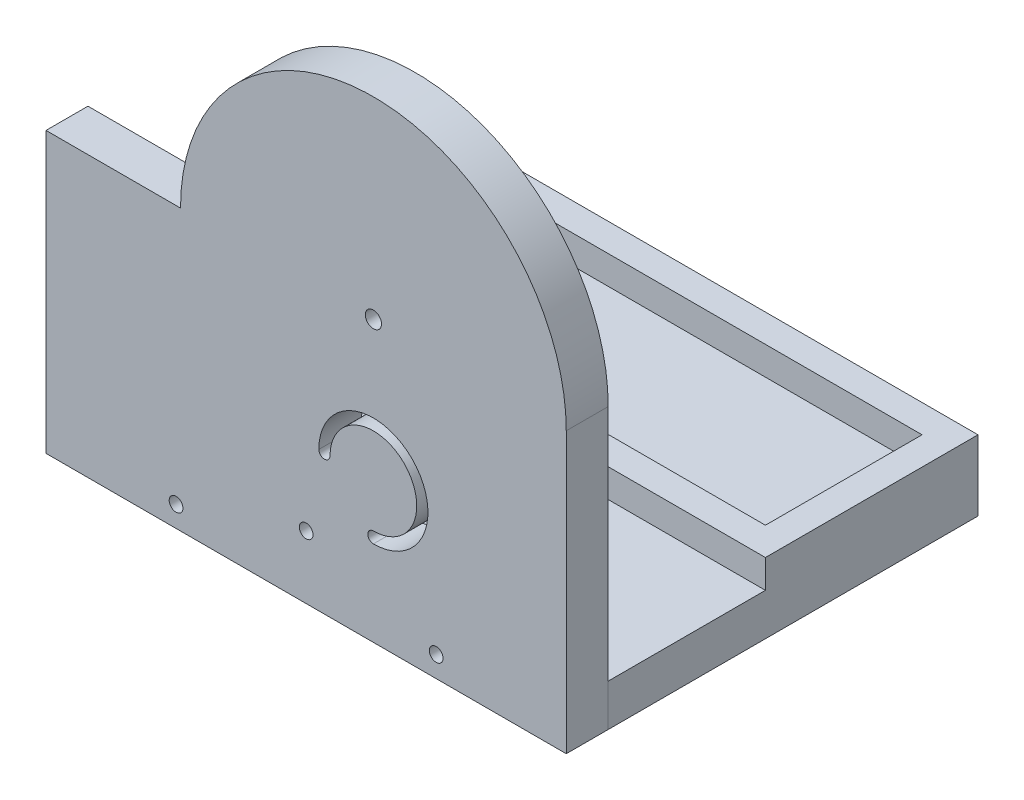
ISO-10303-21;
HEADER;
FILE_DESCRIPTION(('STEP AP214'),'2;1');
FILE_NAME('part.step','',(''),(''),'','','');
FILE_SCHEMA(('AUTOMOTIVE_DESIGN { 1 0 10303 214 1 1 1 1 }'));
ENDSEC;
DATA;
#1=APPLICATION_CONTEXT('core data for automotive mechanical design processes');
#2=APPLICATION_PROTOCOL_DEFINITION('international standard','automotive_design',2000,#1);
#3=PRODUCT_CONTEXT('',#1,'mechanical');
#4=PRODUCT('Part','Part','',(#3));
#5=PRODUCT_RELATED_PRODUCT_CATEGORY('part','',(#4));
#6=PRODUCT_DEFINITION_FORMATION('','',#4);
#7=PRODUCT_DEFINITION_CONTEXT('part definition',#1,'design');
#8=PRODUCT_DEFINITION('design','',#6,#7);
#9=PRODUCT_DEFINITION_SHAPE('','',#8);
#10=(LENGTH_UNIT() NAMED_UNIT(*) SI_UNIT(.MILLI.,.METRE.));
#11=(NAMED_UNIT(*) PLANE_ANGLE_UNIT() SI_UNIT($,.RADIAN.));
#12=(NAMED_UNIT(*) SI_UNIT($,.STERADIAN.) SOLID_ANGLE_UNIT());
#13=UNCERTAINTY_MEASURE_WITH_UNIT(LENGTH_MEASURE(1.E-05),#10,'distance_accuracy_value','');
#14=(GEOMETRIC_REPRESENTATION_CONTEXT(3) GLOBAL_UNCERTAINTY_ASSIGNED_CONTEXT((#13)) GLOBAL_UNIT_ASSIGNED_CONTEXT((#10,
#11,#12)) REPRESENTATION_CONTEXT('',''));
#15=CARTESIAN_POINT('',(0.,0.,0.));
#16=DIRECTION('',(0.,0.,1.));
#17=DIRECTION('',(1.,0.,0.));
#18=AXIS2_PLACEMENT_3D('',#15,#16,#17);
#19=CARTESIAN_POINT('',(0.,0.,71.8519539433691));
#20=DIRECTION('',(0.,0.,-1.));
#21=DIRECTION('',(-1.,0.,0.));
#22=AXIS2_PLACEMENT_3D('',#19,#20,#21);
#23=PLANE('',#22);
#24=DIRECTION('',(0.,1.,0.));
#25=VECTOR('',#24,1.);
#26=CARTESIAN_POINT('',(186.,-87.3912592886284,71.8519539433691));
#27=LINE('',#26,#25);
#28=CARTESIAN_POINT('',(186.,-102.391259288628,71.8519539433691));
#29=VERTEX_POINT('',#28);
#30=CARTESIAN_POINT('',(186.,-2.39125928862841,71.8519539433691));
#31=VERTEX_POINT('',#30);
#32=EDGE_CURVE('E159',#29,#31,#27,.T.);
#33=ORIENTED_EDGE('',*,*,#32,.F.);
#34=DIRECTION('',(-1.,0.,0.));
#35=VECTOR('',#34,1.);
#36=CARTESIAN_POINT('',(186.,-102.391259288628,71.8519539433691));
#37=LINE('',#36,#35);
#38=CARTESIAN_POINT('',(0.,-102.391259288628,71.8519539433691));
#39=VERTEX_POINT('',#38);
#40=EDGE_CURVE('E153',#29,#39,#37,.T.);
#41=ORIENTED_EDGE('',*,*,#40,.T.);
#42=DIRECTION('',(0.,1.,0.));
#43=VECTOR('',#42,1.);
#44=CARTESIAN_POINT('',(0.,-87.3912592886284,71.8519539433691));
#45=LINE('',#44,#43);
#46=CARTESIAN_POINT('',(0.,-2.39125928862841,71.8519539433691));
#47=VERTEX_POINT('',#46);
#48=EDGE_CURVE('E138',#39,#47,#45,.T.);
#49=ORIENTED_EDGE('',*,*,#48,.T.);
#50=DIRECTION('',(-1.,0.,0.));
#51=VECTOR('',#50,1.);
#52=CARTESIAN_POINT('',(48.0885009906099,-2.39125928862841,71.8519539433691));
#53=LINE('',#52,#51);
#54=CARTESIAN_POINT('',(48.0885009906099,-2.39125928862841,71.8519539433691));
#55=VERTEX_POINT('',#54);
#56=EDGE_CURVE('E218',#55,#47,#53,.T.);
#57=ORIENTED_EDGE('',*,*,#56,.F.);
#58=CARTESIAN_POINT('',(117.044250495305,-2.39125928862841,71.8519539433691));
#59=DIRECTION('',(0.,0.,1.));
#60=DIRECTION('',(0.,1.,0.));
#61=AXIS2_PLACEMENT_3D('',#58,#59,#60);
#62=CIRCLE('',#61,68.955749504695);
#63=EDGE_CURVE('E222',#31,#55,#62,.T.);
#64=ORIENTED_EDGE('',*,*,#63,.F.);
#65=EDGE_LOOP('',(#33,#41,#49,#57,#64));
#66=FACE_BOUND('',#65,.T.);
#67=CARTESIAN_POINT('',(139.5,-94.8912592886284,71.8519539433691));
#68=DIRECTION('',(0.,0.,-1.));
#69=DIRECTION('',(-1.,0.,0.));
#70=AXIS2_PLACEMENT_3D('',#67,#68,#69);
#71=CIRCLE('',#70,2.45745);
#72=CARTESIAN_POINT('',(137.04255,-94.8912592886284,71.8519539433691));
#73=VERTEX_POINT('',#72);
#74=EDGE_CURVE('E161',#73,#73,#71,.F.);
#75=ORIENTED_EDGE('',*,*,#74,.T.);
#76=EDGE_LOOP('',(#75));
#77=FACE_BOUND('',#76,.T.);
#78=CARTESIAN_POINT('',(46.5,-94.8912592886284,71.8519539433691));
#79=DIRECTION('',(0.,0.,-1.));
#80=DIRECTION('',(-1.,0.,0.));
#81=AXIS2_PLACEMENT_3D('',#78,#79,#80);
#82=CIRCLE('',#81,2.45745);
#83=CARTESIAN_POINT('',(44.04255,-94.8912592886284,71.8519539433691));
#84=VERTEX_POINT('',#83);
#85=EDGE_CURVE('E171',#84,#84,#82,.F.);
#86=ORIENTED_EDGE('',*,*,#85,.T.);
#87=EDGE_LOOP('',(#86));
#88=FACE_BOUND('',#87,.T.);
#89=CARTESIAN_POINT('',(93.,-79.8912592886284,71.8519539433691));
#90=DIRECTION('',(0.,0.,-1.));
#91=DIRECTION('',(-1.,0.,0.));
#92=AXIS2_PLACEMENT_3D('',#89,#90,#91);
#93=CIRCLE('',#92,2.45745);
#94=CARTESIAN_POINT('',(90.54255,-79.8912592886284,71.8519539433691));
#95=VERTEX_POINT('',#94);
#96=EDGE_CURVE('E165',#95,#95,#93,.F.);
#97=ORIENTED_EDGE('',*,*,#96,.T.);
#98=EDGE_LOOP('',(#97));
#99=FACE_BOUND('',#98,.T.);
#100=CARTESIAN_POINT('',(117.044250495305,-69.8912592886284,71.8519539433691));
#101=DIRECTION('',(0.,0.,-1.));
#102=DIRECTION('',(0.,1.,0.));
#103=AXIS2_PLACEMENT_3D('',#100,#101,#102);
#104=CIRCLE('',#103,1.99999999999997);
#105=CARTESIAN_POINT('',(117.044250495305,-71.8912592886284,71.8519539433691));
#106=VERTEX_POINT('',#105);
#107=CARTESIAN_POINT('',(117.044250495305,-67.8912592886284,71.8519539433691));
#108=VERTEX_POINT('',#107);
#109=EDGE_CURVE('E198',#106,#108,#104,.T.);
#110=ORIENTED_EDGE('',*,*,#109,.F.);
#111=CARTESIAN_POINT('',(117.044250495305,-52.3912592886284,71.8519539433691));
#112=DIRECTION('',(0.,0.,-1.));
#113=DIRECTION('',(0.,1.,0.));
#114=AXIS2_PLACEMENT_3D('',#111,#112,#113);
#115=CIRCLE('',#114,19.5);
#116=CARTESIAN_POINT('',(97.544250495305,-52.3912592886284,71.8519539433691));
#117=VERTEX_POINT('',#116);
#118=EDGE_CURVE('E201',#117,#106,#115,.T.);
#119=ORIENTED_EDGE('',*,*,#118,.F.);
#120=CARTESIAN_POINT('',(99.544250495305,-52.3912592886284,71.8519539433691));
#121=DIRECTION('',(0.,0.,-1.));
#122=DIRECTION('',(0.,1.,0.));
#123=AXIS2_PLACEMENT_3D('',#120,#121,#122);
#124=CIRCLE('',#123,1.99999999999996);
#125=CARTESIAN_POINT('',(101.544250495305,-52.3912592886284,71.8519539433691));
#126=VERTEX_POINT('',#125);
#127=EDGE_CURVE('E185',#126,#117,#124,.T.);
#128=ORIENTED_EDGE('',*,*,#127,.F.);
#129=CARTESIAN_POINT('',(117.044250495305,-52.3912592886284,71.8519539433691));
#130=DIRECTION('',(0.,0.,-1.));
#131=DIRECTION('',(0.,1.,0.));
#132=AXIS2_PLACEMENT_3D('',#129,#130,#131);
#133=CIRCLE('',#132,15.5);
#134=EDGE_CURVE('E195',#126,#108,#133,.T.);
#135=ORIENTED_EDGE('',*,*,#134,.T.);
#136=EDGE_LOOP('',(#110,#119,#128,#135));
#137=FACE_BOUND('',#136,.T.);
#138=CARTESIAN_POINT('',(117.044250495305,-2.39125928862841,71.8519539433691));
#139=DIRECTION('',(0.,0.,-1.));
#140=DIRECTION('',(-1.,0.,0.));
#141=AXIS2_PLACEMENT_3D('',#138,#139,#140);
#142=CIRCLE('',#141,2.89999999999999);
#143=CARTESIAN_POINT('',(114.144250495305,-2.39125928862841,71.8519539433691));
#144=VERTEX_POINT('',#143);
#145=EDGE_CURVE('E211',#144,#144,#142,.T.);
#146=ORIENTED_EDGE('',*,*,#145,.F.);
#147=EDGE_LOOP('',(#146));
#148=FACE_BOUND('',#147,.T.);
#149=ADVANCED_FACE('F64',(#66,#77,#88,#99,#137,#148),#23,.T.);
#150=CARTESIAN_POINT('',(186.,-102.391259288628,86.851953943369));
#151=DIRECTION('',(0.,1.,0.));
#152=DIRECTION('',(0.,0.,1.));
#153=AXIS2_PLACEMENT_3D('',#150,#151,#152);
#154=PLANE('',#153);
#155=ORIENTED_EDGE('',*,*,#40,.F.);
#156=DIRECTION('',(0.,0.,-1.));
#157=VECTOR('',#156,1.);
#158=CARTESIAN_POINT('',(186.,-102.391259288628,86.851953943369));
#159=LINE('',#158,#157);
#160=CARTESIAN_POINT('',(186.,-102.391259288628,86.851953943369));
#161=VERTEX_POINT('',#160);
#162=EDGE_CURVE('E173',#161,#29,#159,.T.);
#163=ORIENTED_EDGE('',*,*,#162,.F.);
#164=DIRECTION('',(-1.,0.,0.));
#165=VECTOR('',#164,1.);
#166=CARTESIAN_POINT('',(186.,-102.391259288628,86.851953943369));
#167=LINE('',#166,#165);
#168=CARTESIAN_POINT('',(0.,-102.391259288628,86.851953943369));
#169=VERTEX_POINT('',#168);
#170=EDGE_CURVE('E155',#161,#169,#167,.T.);
#171=ORIENTED_EDGE('',*,*,#170,.T.);
#172=DIRECTION('',(0.,0.,-1.));
#173=VECTOR('',#172,1.);
#174=CARTESIAN_POINT('',(0.,-102.391259288628,86.851953943369));
#175=LINE('',#174,#173);
#176=EDGE_CURVE('E68',#169,#39,#175,.T.);
#177=ORIENTED_EDGE('',*,*,#176,.T.);
#178=EDGE_LOOP('',(#155,#163,#171,#177));
#179=FACE_BOUND('',#178,.T.);
#180=ADVANCED_FACE('F151',(#179),#154,.F.);
#181=CARTESIAN_POINT('',(99.544250495305,-52.3912592886284,142.00628287592));
#182=DIRECTION('',(0.,0.,-1.));
#183=DIRECTION('',(0.,1.,0.));
#184=AXIS2_PLACEMENT_3D('',#181,#182,#183);
#185=CYLINDRICAL_SURFACE('',#184,1.99999999999996);
#186=CARTESIAN_POINT('',(99.544250495305,-52.3912592886284,86.8519539433691));
#187=DIRECTION('',(0.,0.,-1.));
#188=DIRECTION('',(0.,1.,0.));
#189=AXIS2_PLACEMENT_3D('',#186,#187,#188);
#190=CIRCLE('',#189,1.99999999999996);
#191=CARTESIAN_POINT('',(97.544250495305,-52.3912592886284,86.8519539433691));
#192=VERTEX_POINT('',#191);
#193=CARTESIAN_POINT('',(101.544250495305,-52.3912592886284,86.8519539433691));
#194=VERTEX_POINT('',#193);
#195=EDGE_CURVE('E205',#192,#194,#190,.F.);
#196=ORIENTED_EDGE('',*,*,#195,.T.);
#197=DIRECTION('',(0.,0.,-1.));
#198=VECTOR('',#197,1.);
#199=CARTESIAN_POINT('',(101.544250495305,-52.3912592886284,142.00628287592));
#200=LINE('',#199,#198);
#201=EDGE_CURVE('E188',#194,#126,#200,.T.);
#202=ORIENTED_EDGE('',*,*,#201,.T.);
#203=ORIENTED_EDGE('',*,*,#127,.T.);
#204=DIRECTION('',(0.,0.,-1.));
#205=VECTOR('',#204,1.);
#206=CARTESIAN_POINT('',(97.544250495305,-52.3912592886284,142.00628287592));
#207=LINE('',#206,#205);
#208=EDGE_CURVE('E190',#192,#117,#207,.T.);
#209=ORIENTED_EDGE('',*,*,#208,.F.);
#210=EDGE_LOOP('',(#196,#202,#203,#209));
#211=FACE_BOUND('',#210,.T.);
#212=ADVANCED_FACE('F264',(#211),#185,.F.);
#213=CARTESIAN_POINT('',(117.044250495305,-52.3912592886284,142.00628287592));
#214=DIRECTION('',(0.,0.,-1.));
#215=DIRECTION('',(0.,1.,0.));
#216=AXIS2_PLACEMENT_3D('',#213,#214,#215);
#217=CYLINDRICAL_SURFACE('',#216,15.5);
#218=DIRECTION('',(0.,0.,-1.));
#219=VECTOR('',#218,1.);
#220=CARTESIAN_POINT('',(117.044250495305,-67.8912592886284,142.00628287592));
#221=LINE('',#220,#219);
#222=CARTESIAN_POINT('',(117.044250495305,-67.8912592886284,86.8519539433691));
#223=VERTEX_POINT('',#222);
#224=EDGE_CURVE('E186',#223,#108,#221,.T.);
#225=ORIENTED_EDGE('',*,*,#224,.T.);
#226=ORIENTED_EDGE('',*,*,#134,.F.);
#227=ORIENTED_EDGE('',*,*,#201,.F.);
#228=CARTESIAN_POINT('',(117.044250495305,-52.3912592886284,86.8519539433691));
#229=DIRECTION('',(0.,0.,-1.));
#230=DIRECTION('',(0.,1.,0.));
#231=AXIS2_PLACEMENT_3D('',#228,#229,#230);
#232=CIRCLE('',#231,15.5);
#233=EDGE_CURVE('E192',#223,#194,#232,.F.);
#234=ORIENTED_EDGE('',*,*,#233,.F.);
#235=EDGE_LOOP('',(#225,#226,#227,#234));
#236=FACE_BOUND('',#235,.T.);
#237=ADVANCED_FACE('F258',(#236),#217,.T.);
#238=CARTESIAN_POINT('',(117.044250495305,-52.3912592886284,142.00628287592));
#239=DIRECTION('',(0.,0.,-1.));
#240=DIRECTION('',(0.,1.,0.));
#241=AXIS2_PLACEMENT_3D('',#238,#239,#240);
#242=CYLINDRICAL_SURFACE('',#241,19.5);
#243=CARTESIAN_POINT('',(117.044250495305,-52.3912592886284,86.8519539433691));
#244=DIRECTION('',(0.,0.,-1.));
#245=DIRECTION('',(0.,1.,0.));
#246=AXIS2_PLACEMENT_3D('',#243,#244,#245);
#247=CIRCLE('',#246,19.5);
#248=CARTESIAN_POINT('',(117.044250495305,-71.8912592886284,86.8519539433691));
#249=VERTEX_POINT('',#248);
#250=EDGE_CURVE('E181',#249,#192,#247,.F.);
#251=ORIENTED_EDGE('',*,*,#250,.T.);
#252=ORIENTED_EDGE('',*,*,#208,.T.);
#253=ORIENTED_EDGE('',*,*,#118,.T.);
#254=DIRECTION('',(0.,0.,-1.));
#255=VECTOR('',#254,1.);
#256=CARTESIAN_POINT('',(117.044250495305,-71.8912592886284,142.00628287592));
#257=LINE('',#256,#255);
#258=EDGE_CURVE('E182',#249,#106,#257,.T.);
#259=ORIENTED_EDGE('',*,*,#258,.F.);
#260=EDGE_LOOP('',(#251,#252,#253,#259));
#261=FACE_BOUND('',#260,.T.);
#262=ADVANCED_FACE('F252',(#261),#242,.F.);
#263=CARTESIAN_POINT('',(186.,0.,0.));
#264=DIRECTION('',(1.,0.,0.));
#265=DIRECTION('',(0.,0.,-1.));
#266=AXIS2_PLACEMENT_3D('',#263,#264,#265);
#267=PLANE('',#266);
#268=ORIENTED_EDGE('',*,*,#162,.T.);
#269=ORIENTED_EDGE('',*,*,#32,.T.);
#270=DIRECTION('',(0.,0.,-1.));
#271=VECTOR('',#270,1.);
#272=CARTESIAN_POINT('',(186.,-2.39125928862839,285.587959740004));
#273=LINE('',#272,#271);
#274=CARTESIAN_POINT('',(186.,-2.39125928862841,86.8519539433691));
#275=VERTEX_POINT('',#274);
#276=EDGE_CURVE('E88',#275,#31,#273,.T.);
#277=ORIENTED_EDGE('',*,*,#276,.F.);
#278=DIRECTION('',(0.,-1.,0.));
#279=VECTOR('',#278,1.);
#280=CARTESIAN_POINT('',(186.,67.6087407113716,86.8519539433691));
#281=LINE('',#280,#279);
#282=EDGE_CURVE('E146',#275,#161,#281,.T.);
#283=ORIENTED_EDGE('',*,*,#282,.T.);
#284=EDGE_LOOP('',(#268,#269,#277,#283));
#285=FACE_BOUND('',#284,.T.);
#286=ADVANCED_FACE('F250',(#285),#267,.T.);
#287=CARTESIAN_POINT('',(0.,0.,0.));
#288=DIRECTION('',(1.,0.,0.));
#289=DIRECTION('',(0.,0.,-1.));
#290=AXIS2_PLACEMENT_3D('',#287,#288,#289);
#291=PLANE('',#290);
#292=ORIENTED_EDGE('',*,*,#48,.F.);
#293=ORIENTED_EDGE('',*,*,#176,.F.);
#294=DIRECTION('',(0.,-1.,0.));
#295=VECTOR('',#294,1.);
#296=CARTESIAN_POINT('',(0.,67.6087407113716,86.8519539433691));
#297=LINE('',#296,#295);
#298=CARTESIAN_POINT('',(0.,-2.3912592886284,86.8519539433691));
#299=VERTEX_POINT('',#298);
#300=EDGE_CURVE('E156',#299,#169,#297,.T.);
#301=ORIENTED_EDGE('',*,*,#300,.F.);
#302=DIRECTION('',(0.,0.,-1.));
#303=VECTOR('',#302,1.);
#304=CARTESIAN_POINT('',(0.,-2.39125928862839,285.587959740004));
#305=LINE('',#304,#303);
#306=EDGE_CURVE('E142',#299,#47,#305,.T.);
#307=ORIENTED_EDGE('',*,*,#306,.T.);
#308=EDGE_LOOP('',(#292,#293,#301,#307));
#309=FACE_BOUND('',#308,.T.);
#310=ADVANCED_FACE('F140',(#309),#291,.F.);
#311=CARTESIAN_POINT('',(117.044250495305,-2.39125928862839,285.587959740004));
#312=DIRECTION('',(0.,0.,-1.));
#313=DIRECTION('',(0.,1.,0.));
#314=AXIS2_PLACEMENT_3D('',#311,#312,#313);
#315=CYLINDRICAL_SURFACE('',#314,68.955749504695);
#316=CARTESIAN_POINT('',(117.044250495305,-2.3912592886284,86.8519539433691));
#317=DIRECTION('',(0.,0.,-1.));
#318=DIRECTION('',(0.,1.,0.));
#319=AXIS2_PLACEMENT_3D('',#316,#317,#318);
#320=CIRCLE('',#319,68.955749504695);
#321=CARTESIAN_POINT('',(48.0885009906099,-2.3912592886284,86.8519539433691));
#322=VERTEX_POINT('',#321);
#323=EDGE_CURVE('E216',#322,#275,#320,.T.);
#324=ORIENTED_EDGE('',*,*,#323,.T.);
#325=ORIENTED_EDGE('',*,*,#276,.T.);
#326=ORIENTED_EDGE('',*,*,#63,.T.);
#327=DIRECTION('',(0.,0.,-1.));
#328=VECTOR('',#327,1.);
#329=CARTESIAN_POINT('',(48.0885009906099,-2.39125928862839,285.587959740004));
#330=LINE('',#329,#328);
#331=EDGE_CURVE('E81',#322,#55,#330,.T.);
#332=ORIENTED_EDGE('',*,*,#331,.F.);
#333=EDGE_LOOP('',(#324,#325,#326,#332));
#334=FACE_BOUND('',#333,.T.);
#335=ADVANCED_FACE('F237',(#334),#315,.T.);
#336=CARTESIAN_POINT('',(186.,67.6087407113716,86.8519539433691));
#337=DIRECTION('',(0.,0.,-1.));
#338=DIRECTION('',(0.,1.,0.));
#339=AXIS2_PLACEMENT_3D('',#336,#337,#338);
#340=PLANE('',#339);
#341=CARTESIAN_POINT('',(46.5,-94.8912592886284,86.8519539433691));
#342=DIRECTION('',(0.,0.,1.));
#343=DIRECTION('',(0.,-1.,0.));
#344=AXIS2_PLACEMENT_3D('',#341,#342,#343);
#345=CIRCLE('',#344,2.45745);
#346=CARTESIAN_POINT('',(46.5,-97.3487092886284,86.8519539433691));
#347=VERTEX_POINT('',#346);
#348=EDGE_CURVE('E13',#347,#347,#345,.T.);
#349=ORIENTED_EDGE('',*,*,#348,.F.);
#350=EDGE_LOOP('',(#349));
#351=FACE_BOUND('',#350,.T.);
#352=CARTESIAN_POINT('',(93.,-79.8912592886284,86.8519539433691));
#353=DIRECTION('',(0.,0.,1.));
#354=DIRECTION('',(0.,-1.,0.));
#355=AXIS2_PLACEMENT_3D('',#352,#353,#354);
#356=CIRCLE('',#355,2.45745);
#357=CARTESIAN_POINT('',(93.,-82.3487092886284,86.8519539433691));
#358=VERTEX_POINT('',#357);
#359=EDGE_CURVE('E73',#358,#358,#356,.T.);
#360=ORIENTED_EDGE('',*,*,#359,.F.);
#361=EDGE_LOOP('',(#360));
#362=FACE_BOUND('',#361,.T.);
#363=CARTESIAN_POINT('',(139.5,-94.8912592886284,86.8519539433691));
#364=DIRECTION('',(0.,0.,1.));
#365=DIRECTION('',(0.,-1.,0.));
#366=AXIS2_PLACEMENT_3D('',#363,#364,#365);
#367=CIRCLE('',#366,2.45745);
#368=CARTESIAN_POINT('',(139.5,-97.3487092886284,86.8519539433691));
#369=VERTEX_POINT('',#368);
#370=EDGE_CURVE('E224',#369,#369,#367,.T.);
#371=ORIENTED_EDGE('',*,*,#370,.F.);
#372=EDGE_LOOP('',(#371));
#373=FACE_BOUND('',#372,.T.);
#374=CARTESIAN_POINT('',(117.044250495305,-2.39125928862841,86.8519539433691));
#375=DIRECTION('',(0.,0.,-1.));
#376=DIRECTION('',(-1.,0.,0.));
#377=AXIS2_PLACEMENT_3D('',#374,#375,#376);
#378=CIRCLE('',#377,2.89999999999999);
#379=CARTESIAN_POINT('',(114.144250495305,-2.39125928862841,86.8519539433691));
#380=VERTEX_POINT('',#379);
#381=EDGE_CURVE('E203',#380,#380,#378,.T.);
#382=ORIENTED_EDGE('',*,*,#381,.T.);
#383=EDGE_LOOP('',(#382));
#384=FACE_BOUND('',#383,.T.);
#385=ORIENTED_EDGE('',*,*,#195,.F.);
#386=ORIENTED_EDGE('',*,*,#250,.F.);
#387=CARTESIAN_POINT('',(117.044250495305,-69.8912592886284,86.8519539433691));
#388=DIRECTION('',(0.,0.,-1.));
#389=DIRECTION('',(0.,1.,0.));
#390=AXIS2_PLACEMENT_3D('',#387,#388,#389);
#391=CIRCLE('',#390,1.99999999999997);
#392=EDGE_CURVE('E179',#223,#249,#391,.F.);
#393=ORIENTED_EDGE('',*,*,#392,.F.);
#394=ORIENTED_EDGE('',*,*,#233,.T.);
#395=EDGE_LOOP('',(#385,#386,#393,#394));
#396=FACE_BOUND('',#395,.T.);
#397=ORIENTED_EDGE('',*,*,#282,.F.);
#398=ORIENTED_EDGE('',*,*,#323,.F.);
#399=DIRECTION('',(1.,0.,0.));
#400=VECTOR('',#399,1.);
#401=CARTESIAN_POINT('',(48.0885009906099,-2.3912592886284,86.8519539433691));
#402=LINE('',#401,#400);
#403=EDGE_CURVE('E214',#299,#322,#402,.T.);
#404=ORIENTED_EDGE('',*,*,#403,.F.);
#405=ORIENTED_EDGE('',*,*,#300,.T.);
#406=ORIENTED_EDGE('',*,*,#170,.F.);
#407=EDGE_LOOP('',(#397,#398,#404,#405,#406));
#408=FACE_BOUND('',#407,.T.);
#409=ADVANCED_FACE('F233',(#351,#362,#373,#384,#396,#408),#340,.F.);
#410=CARTESIAN_POINT('',(46.5,-94.8912592886284,86.8519539433691));
#411=DIRECTION('',(0.,0.,1.));
#412=DIRECTION('',(0.,-1.,0.));
#413=AXIS2_PLACEMENT_3D('',#410,#411,#412);
#414=CYLINDRICAL_SURFACE('',#413,2.45745);
#415=ORIENTED_EDGE('',*,*,#348,.T.);
#416=EDGE_LOOP('',(#415));
#417=FACE_BOUND('',#416,.T.);
#418=ORIENTED_EDGE('',*,*,#85,.F.);
#419=EDGE_LOOP('',(#418));
#420=FACE_BOUND('',#419,.T.);
#421=ADVANCED_FACE('F236',(#417,#420),#414,.F.);
#422=CARTESIAN_POINT('',(93.,-79.8912592886284,86.8519539433691));
#423=DIRECTION('',(0.,0.,1.));
#424=DIRECTION('',(0.,-1.,0.));
#425=AXIS2_PLACEMENT_3D('',#422,#423,#424);
#426=CYLINDRICAL_SURFACE('',#425,2.45745);
#427=ORIENTED_EDGE('',*,*,#359,.T.);
#428=EDGE_LOOP('',(#427));
#429=FACE_BOUND('',#428,.T.);
#430=ORIENTED_EDGE('',*,*,#96,.F.);
#431=EDGE_LOOP('',(#430));
#432=FACE_BOUND('',#431,.T.);
#433=ADVANCED_FACE('F230',(#429,#432),#426,.F.);
#434=CARTESIAN_POINT('',(139.5,-94.8912592886284,86.8519539433691));
#435=DIRECTION('',(0.,0.,1.));
#436=DIRECTION('',(0.,-1.,0.));
#437=AXIS2_PLACEMENT_3D('',#434,#435,#436);
#438=CYLINDRICAL_SURFACE('',#437,2.45745);
#439=ORIENTED_EDGE('',*,*,#370,.T.);
#440=EDGE_LOOP('',(#439));
#441=FACE_BOUND('',#440,.T.);
#442=ORIENTED_EDGE('',*,*,#74,.F.);
#443=EDGE_LOOP('',(#442));
#444=FACE_BOUND('',#443,.T.);
#445=ADVANCED_FACE('F66',(#441,#444),#438,.F.);
#446=CARTESIAN_POINT('',(48.0885009906099,-2.39125928862839,285.587959740004));
#447=DIRECTION('',(0.,-1.,0.));
#448=DIRECTION('',(0.,0.,-1.));
#449=AXIS2_PLACEMENT_3D('',#446,#447,#448);
#450=PLANE('',#449);
#451=ORIENTED_EDGE('',*,*,#403,.T.);
#452=ORIENTED_EDGE('',*,*,#331,.T.);
#453=ORIENTED_EDGE('',*,*,#56,.T.);
#454=ORIENTED_EDGE('',*,*,#306,.F.);
#455=EDGE_LOOP('',(#451,#452,#453,#454));
#456=FACE_BOUND('',#455,.T.);
#457=ADVANCED_FACE('F279',(#456),#450,.F.);
#458=CARTESIAN_POINT('',(117.044250495305,-2.39125928862841,71.8519539433691));
#459=DIRECTION('',(0.,0.,-1.));
#460=DIRECTION('',(-1.,0.,0.));
#461=AXIS2_PLACEMENT_3D('',#458,#459,#460);
#462=CYLINDRICAL_SURFACE('',#461,2.89999999999999);
#463=ORIENTED_EDGE('',*,*,#381,.F.);
#464=EDGE_LOOP('',(#463));
#465=FACE_BOUND('',#464,.T.);
#466=ORIENTED_EDGE('',*,*,#145,.T.);
#467=EDGE_LOOP('',(#466));
#468=FACE_BOUND('',#467,.T.);
#469=ADVANCED_FACE('F288',(#465,#468),#462,.F.);
#470=CARTESIAN_POINT('',(117.044250495305,-69.8912592886284,142.00628287592));
#471=DIRECTION('',(0.,0.,-1.));
#472=DIRECTION('',(0.,1.,0.));
#473=AXIS2_PLACEMENT_3D('',#470,#471,#472);
#474=CYLINDRICAL_SURFACE('',#473,1.99999999999997);
#475=ORIENTED_EDGE('',*,*,#392,.T.);
#476=ORIENTED_EDGE('',*,*,#258,.T.);
#477=ORIENTED_EDGE('',*,*,#109,.T.);
#478=ORIENTED_EDGE('',*,*,#224,.F.);
#479=EDGE_LOOP('',(#475,#476,#477,#478));
#480=FACE_BOUND('',#479,.T.);
#481=ADVANCED_FACE('F273',(#480),#474,.F.);
#482=CLOSED_SHELL('',(#149,#180,#212,#237,#262,#286,#310,#335,#409,#421,#433,#445,#457,#469,#481));
#483=MANIFOLD_SOLID_BREP('B2',#482);
#484=CARTESIAN_POINT('',(0.,0.,71.8519539433691));
#485=DIRECTION('',(0.,0.,-1.));
#486=DIRECTION('',(-1.,0.,0.));
#487=AXIS2_PLACEMENT_3D('',#484,#485,#486);
#488=PLANE('',#487);
#489=DIRECTION('',(0.,1.,0.));
#490=VECTOR('',#489,1.);
#491=CARTESIAN_POINT('',(186.,0.,71.8519539433691));
#492=LINE('',#491,#490);
#493=CARTESIAN_POINT('',(186.,-102.391259288628,71.8519539433691));
#494=VERTEX_POINT('',#493);
#495=CARTESIAN_POINT('',(186.,-87.3912592886284,71.8519539433691));
#496=VERTEX_POINT('',#495);
#497=EDGE_CURVE('E422',#494,#496,#492,.T.);
#498=ORIENTED_EDGE('',*,*,#497,.T.);
#499=DIRECTION('',(-1.,0.,0.));
#500=VECTOR('',#499,1.);
#501=CARTESIAN_POINT('',(186.,-87.3912592886284,71.8519539433691));
#502=LINE('',#501,#500);
#503=CARTESIAN_POINT('',(100.5,-87.3912592886284,71.8519539433691));
#504=VERTEX_POINT('',#503);
#505=EDGE_CURVE('E428',#496,#504,#502,.T.);
#506=ORIENTED_EDGE('',*,*,#505,.T.);
#507=DIRECTION('',(0.,-1.,0.));
#508=VECTOR('',#507,1.);
#509=CARTESIAN_POINT('',(100.5,-79.8912592886284,71.8519539433691));
#510=LINE('',#509,#508);
#511=CARTESIAN_POINT('',(100.5,-79.8912592886284,71.8519539433691));
#512=VERTEX_POINT('',#511);
#513=EDGE_CURVE('E566',#512,#504,#510,.T.);
#514=ORIENTED_EDGE('',*,*,#513,.F.);
#515=CARTESIAN_POINT('',(93.,-79.8912592886284,71.8519539433691));
#516=DIRECTION('',(0.,0.,-1.));
#517=DIRECTION('',(-1.,0.,0.));
#518=AXIS2_PLACEMENT_3D('',#515,#516,#517);
#519=CIRCLE('',#518,7.5);
#520=CARTESIAN_POINT('',(85.5,-79.8912592886284,71.8519539433691));
#521=VERTEX_POINT('',#520);
#522=EDGE_CURVE('E546',#521,#512,#519,.T.);
#523=ORIENTED_EDGE('',*,*,#522,.F.);
#524=DIRECTION('',(0.,1.,0.));
#525=VECTOR('',#524,1.);
#526=CARTESIAN_POINT('',(85.5,-87.3912592886284,71.8519539433691));
#527=LINE('',#526,#525);
#528=CARTESIAN_POINT('',(85.5,-87.3912592886284,71.8519539433691));
#529=VERTEX_POINT('',#528);
#530=EDGE_CURVE('E552',#529,#521,#527,.T.);
#531=ORIENTED_EDGE('',*,*,#530,.F.);
#532=CARTESIAN_POINT('',(0.,-87.3912592886284,71.8519539433691));
#533=VERTEX_POINT('',#532);
#534=EDGE_CURVE('E62',#529,#533,#502,.T.);
#535=ORIENTED_EDGE('',*,*,#534,.T.);
#536=DIRECTION('',(0.,1.,0.));
#537=VECTOR('',#536,1.);
#538=CARTESIAN_POINT('',(0.,0.,71.8519539433691));
#539=LINE('',#538,#537);
#540=CARTESIAN_POINT('',(0.,-102.391259288628,71.8519539433691));
#541=VERTEX_POINT('',#540);
#542=EDGE_CURVE('E436',#541,#533,#539,.T.);
#543=ORIENTED_EDGE('',*,*,#542,.F.);
#544=DIRECTION('',(-1.,0.,0.));
#545=VECTOR('',#544,1.);
#546=CARTESIAN_POINT('',(186.,-102.391259288628,71.8519539433691));
#547=LINE('',#546,#545);
#548=EDGE_CURVE('E691',#494,#541,#547,.T.);
#549=ORIENTED_EDGE('',*,*,#548,.F.);
#550=EDGE_LOOP('',(#498,#506,#514,#523,#531,#535,#543,#549));
#551=FACE_BOUND('',#550,.T.);
#552=CARTESIAN_POINT('',(93.,-79.8912592886284,71.8519539433691));
#553=DIRECTION('',(0.,0.,-1.));
#554=DIRECTION('',(-1.,0.,0.));
#555=AXIS2_PLACEMENT_3D('',#552,#553,#554);
#556=CIRCLE('',#555,2.45745);
#557=CARTESIAN_POINT('',(90.54255,-79.8912592886284,71.8519539433691));
#558=VERTEX_POINT('',#557);
#559=EDGE_CURVE('E682',#558,#558,#556,.F.);
#560=ORIENTED_EDGE('',*,*,#559,.F.);
#561=EDGE_LOOP('',(#560));
#562=FACE_BOUND('',#561,.T.);
#563=CARTESIAN_POINT('',(46.5,-94.8912592886284,71.8519539433691));
#564=DIRECTION('',(0.,0.,-1.));
#565=DIRECTION('',(-1.,0.,0.));
#566=AXIS2_PLACEMENT_3D('',#563,#564,#565);
#567=CIRCLE('',#566,2.45745);
#568=CARTESIAN_POINT('',(44.04255,-94.8912592886284,71.8519539433691));
#569=VERTEX_POINT('',#568);
#570=EDGE_CURVE('E678',#569,#569,#567,.F.);
#571=ORIENTED_EDGE('',*,*,#570,.F.);
#572=EDGE_LOOP('',(#571));
#573=FACE_BOUND('',#572,.T.);
#574=CARTESIAN_POINT('',(139.5,-94.8912592886284,71.8519539433691));
#575=DIRECTION('',(0.,0.,-1.));
#576=DIRECTION('',(-1.,0.,0.));
#577=AXIS2_PLACEMENT_3D('',#574,#575,#576);
#578=CIRCLE('',#577,2.45745);
#579=CARTESIAN_POINT('',(137.04255,-94.8912592886284,71.8519539433691));
#580=VERTEX_POINT('',#579);
#581=EDGE_CURVE('E686',#580,#580,#578,.F.);
#582=ORIENTED_EDGE('',*,*,#581,.F.);
#583=EDGE_LOOP('',(#582));
#584=FACE_BOUND('',#583,.T.);
#585=ADVANCED_FACE('F419',(#551,#562,#573,#584),#488,.F.);
#586=CARTESIAN_POINT('',(46.5,-94.8912592886284,56.8519539433691));
#587=DIRECTION('',(0.,0.,1.));
#588=DIRECTION('',(0.,-1.,0.));
#589=AXIS2_PLACEMENT_3D('',#586,#587,#588);
#590=CONICAL_SURFACE('',#589,2.45744999999999,1.02974425867665);
#591=CARTESIAN_POINT('',(46.5,-94.8912592886284,55.3753690151398));
#592=VERTEX_POINT('',#591);
#593=VERTEX_LOOP('',#592);
#594=FACE_BOUND('',#593,.T.);
#595=CARTESIAN_POINT('',(46.5,-94.8912592886284,56.8519539433691));
#596=DIRECTION('',(0.,0.,1.));
#597=DIRECTION('',(0.,-1.,0.));
#598=AXIS2_PLACEMENT_3D('',#595,#596,#597);
#599=CIRCLE('',#598,2.45744999999999);
#600=CARTESIAN_POINT('',(46.5,-97.3487092886284,56.8519539433691));
#601=VERTEX_POINT('',#600);
#602=EDGE_CURVE('E533',#601,#601,#599,.T.);
#603=ORIENTED_EDGE('',*,*,#602,.T.);
#604=EDGE_LOOP('',(#603));
#605=FACE_BOUND('',#604,.T.);
#606=ADVANCED_FACE('F526',(#594,#605),#590,.F.);
#607=CARTESIAN_POINT('',(46.5,-94.8912592886284,86.8519539433691));
#608=DIRECTION('',(0.,0.,1.));
#609=DIRECTION('',(0.,-1.,0.));
#610=AXIS2_PLACEMENT_3D('',#607,#608,#609);
#611=CYLINDRICAL_SURFACE('',#610,2.45745);
#612=ORIENTED_EDGE('',*,*,#570,.T.);
#613=EDGE_LOOP('',(#612));
#614=FACE_BOUND('',#613,.T.);
#615=ORIENTED_EDGE('',*,*,#602,.F.);
#616=EDGE_LOOP('',(#615));
#617=FACE_BOUND('',#616,.T.);
#618=ADVANCED_FACE('F529',(#614,#617),#611,.F.);
#619=CARTESIAN_POINT('',(186.,-87.3912592886284,-60.3480460566309));
#620=DIRECTION('',(0.,-1.,0.));
#621=DIRECTION('',(0.,0.,-1.));
#622=AXIS2_PLACEMENT_3D('',#619,#620,#621);
#623=PLANE('',#622);
#624=DIRECTION('',(-1.,0.,0.));
#625=VECTOR('',#624,1.);
#626=CARTESIAN_POINT('',(10.,-87.3912592886284,-50.3480460566309));
#627=LINE('',#626,#625);
#628=CARTESIAN_POINT('',(176.,-87.3912592886284,-50.3480460566309));
#629=VERTEX_POINT('',#628);
#630=CARTESIAN_POINT('',(10.,-87.3912592886284,-50.3480460566309));
#631=VERTEX_POINT('',#630);
#632=EDGE_CURVE('E590',#629,#631,#627,.T.);
#633=ORIENTED_EDGE('',*,*,#632,.T.);
#634=DIRECTION('',(0.,0.,1.));
#635=VECTOR('',#634,1.);
#636=CARTESIAN_POINT('',(10.,-87.3912592886284,5.65195394336908));
#637=LINE('',#636,#635);
#638=CARTESIAN_POINT('',(10.,-87.3912592886284,5.65195394336908));
#639=VERTEX_POINT('',#638);
#640=EDGE_CURVE('E585',#631,#639,#637,.T.);
#641=ORIENTED_EDGE('',*,*,#640,.T.);
#642=DIRECTION('',(1.,0.,0.));
#643=VECTOR('',#642,1.);
#644=CARTESIAN_POINT('',(176.,-87.3912592886284,5.65195394336906));
#645=LINE('',#644,#643);
#646=CARTESIAN_POINT('',(176.,-87.3912592886284,5.65195394336906));
#647=VERTEX_POINT('',#646);
#648=EDGE_CURVE('E604',#639,#647,#645,.T.);
#649=ORIENTED_EDGE('',*,*,#648,.T.);
#650=DIRECTION('',(0.,0.,-1.));
#651=VECTOR('',#650,1.);
#652=CARTESIAN_POINT('',(176.,-87.3912592886284,-50.3480460566309));
#653=LINE('',#652,#651);
#654=EDGE_CURVE('E608',#647,#629,#653,.T.);
#655=ORIENTED_EDGE('',*,*,#654,.T.);
#656=EDGE_LOOP('',(#633,#641,#649,#655));
#657=FACE_BOUND('',#656,.T.);
#658=ADVANCED_FACE('F767',(#657),#623,.F.);
#659=CARTESIAN_POINT('',(176.,-77.2312592886284,5.65195394336906));
#660=DIRECTION('',(0.,0.,-1.));
#661=DIRECTION('',(-1.,0.,0.));
#662=AXIS2_PLACEMENT_3D('',#659,#660,#661);
#663=PLANE('',#662);
#664=ORIENTED_EDGE('',*,*,#648,.F.);
#665=DIRECTION('',(0.,-1.,0.));
#666=VECTOR('',#665,1.);
#667=CARTESIAN_POINT('',(10.,-77.2312592886284,5.65195394336908));
#668=LINE('',#667,#666);
#669=CARTESIAN_POINT('',(10.,-77.2312592886284,5.65195394336908));
#670=VERTEX_POINT('',#669);
#671=EDGE_CURVE('E623',#670,#639,#668,.T.);
#672=ORIENTED_EDGE('',*,*,#671,.F.);
#673=DIRECTION('',(1.,0.,0.));
#674=VECTOR('',#673,1.);
#675=CARTESIAN_POINT('',(176.,-77.2312592886284,5.65195394336906));
#676=LINE('',#675,#674);
#677=CARTESIAN_POINT('',(176.,-77.2312592886284,5.65195394336906));
#678=VERTEX_POINT('',#677);
#679=EDGE_CURVE('E589',#670,#678,#676,.T.);
#680=ORIENTED_EDGE('',*,*,#679,.T.);
#681=DIRECTION('',(0.,-1.,0.));
#682=VECTOR('',#681,1.);
#683=CARTESIAN_POINT('',(176.,-77.2312592886284,5.65195394336906));
#684=LINE('',#683,#682);
#685=EDGE_CURVE('E620',#678,#647,#684,.T.);
#686=ORIENTED_EDGE('',*,*,#685,.T.);
#687=EDGE_LOOP('',(#664,#672,#680,#686));
#688=FACE_BOUND('',#687,.T.);
#689=ADVANCED_FACE('F763',(#688),#663,.T.);
#690=CARTESIAN_POINT('',(176.,-77.2312592886284,-50.3480460566309));
#691=DIRECTION('',(-1.,0.,0.));
#692=DIRECTION('',(0.,0.,1.));
#693=AXIS2_PLACEMENT_3D('',#690,#691,#692);
#694=PLANE('',#693);
#695=ORIENTED_EDGE('',*,*,#654,.F.);
#696=ORIENTED_EDGE('',*,*,#685,.F.);
#697=DIRECTION('',(0.,0.,-1.));
#698=VECTOR('',#697,1.);
#699=CARTESIAN_POINT('',(176.,-77.2312592886284,-50.3480460566309));
#700=LINE('',#699,#698);
#701=CARTESIAN_POINT('',(176.,-77.2312592886284,-50.3480460566309));
#702=VERTEX_POINT('',#701);
#703=EDGE_CURVE('E593',#678,#702,#700,.T.);
#704=ORIENTED_EDGE('',*,*,#703,.T.);
#705=DIRECTION('',(0.,-1.,0.));
#706=VECTOR('',#705,1.);
#707=CARTESIAN_POINT('',(176.,-77.2312592886284,-50.3480460566309));
#708=LINE('',#707,#706);
#709=EDGE_CURVE('E617',#702,#629,#708,.T.);
#710=ORIENTED_EDGE('',*,*,#709,.T.);
#711=EDGE_LOOP('',(#695,#696,#704,#710));
#712=FACE_BOUND('',#711,.T.);
#713=ADVANCED_FACE('F759',(#712),#694,.T.);
#714=CARTESIAN_POINT('',(10.,-77.2312592886284,-50.3480460566309));
#715=DIRECTION('',(0.,0.,1.));
#716=DIRECTION('',(1.,0.,0.));
#717=AXIS2_PLACEMENT_3D('',#714,#715,#716);
#718=PLANE('',#717);
#719=ORIENTED_EDGE('',*,*,#632,.F.);
#720=ORIENTED_EDGE('',*,*,#709,.F.);
#721=DIRECTION('',(-1.,0.,0.));
#722=VECTOR('',#721,1.);
#723=CARTESIAN_POINT('',(10.,-77.2312592886284,-50.3480460566309));
#724=LINE('',#723,#722);
#725=CARTESIAN_POINT('',(10.,-77.2312592886284,-50.3480460566309));
#726=VERTEX_POINT('',#725);
#727=EDGE_CURVE('E597',#702,#726,#724,.T.);
#728=ORIENTED_EDGE('',*,*,#727,.T.);
#729=DIRECTION('',(0.,-1.,0.));
#730=VECTOR('',#729,1.);
#731=CARTESIAN_POINT('',(10.,-77.2312592886284,-50.3480460566309));
#732=LINE('',#731,#730);
#733=EDGE_CURVE('E600',#726,#631,#732,.T.);
#734=ORIENTED_EDGE('',*,*,#733,.T.);
#735=EDGE_LOOP('',(#719,#720,#728,#734));
#736=FACE_BOUND('',#735,.T.);
#737=ADVANCED_FACE('F755',(#736),#718,.T.);
#738=CARTESIAN_POINT('',(10.,-77.2312592886284,5.65195394336908));
#739=DIRECTION('',(1.,0.,0.));
#740=DIRECTION('',(0.,0.,-1.));
#741=AXIS2_PLACEMENT_3D('',#738,#739,#740);
#742=PLANE('',#741);
#743=ORIENTED_EDGE('',*,*,#640,.F.);
#744=ORIENTED_EDGE('',*,*,#733,.F.);
#745=DIRECTION('',(0.,0.,1.));
#746=VECTOR('',#745,1.);
#747=CARTESIAN_POINT('',(10.,-77.2312592886284,5.65195394336908));
#748=LINE('',#747,#746);
#749=EDGE_CURVE('E586',#726,#670,#748,.T.);
#750=ORIENTED_EDGE('',*,*,#749,.T.);
#751=ORIENTED_EDGE('',*,*,#671,.T.);
#752=EDGE_LOOP('',(#743,#744,#750,#751));
#753=FACE_BOUND('',#752,.T.);
#754=ADVANCED_FACE('F758',(#753),#742,.T.);
#755=CARTESIAN_POINT('',(186.,0.,0.));
#756=DIRECTION('',(1.,0.,0.));
#757=DIRECTION('',(0.,0.,-1.));
#758=AXIS2_PLACEMENT_3D('',#755,#756,#757);
#759=PLANE('',#758);
#760=ORIENTED_EDGE('',*,*,#497,.F.);
#761=DIRECTION('',(0.,0.,-1.));
#762=VECTOR('',#761,1.);
#763=CARTESIAN_POINT('',(186.,-102.391259288628,86.851953943369));
#764=LINE('',#763,#762);
#765=CARTESIAN_POINT('',(186.,-102.391259288628,-60.3480460566309));
#766=VERTEX_POINT('',#765);
#767=EDGE_CURVE('E655',#494,#766,#764,.T.);
#768=ORIENTED_EDGE('',*,*,#767,.T.);
#769=DIRECTION('',(0.,1.,0.));
#770=VECTOR('',#769,1.);
#771=CARTESIAN_POINT('',(186.,-102.391259288628,-60.3480460566309));
#772=LINE('',#771,#770);
#773=CARTESIAN_POINT('',(186.,-77.2312592886284,-60.3480460566309));
#774=VERTEX_POINT('',#773);
#775=EDGE_CURVE('E658',#766,#774,#772,.T.);
#776=ORIENTED_EDGE('',*,*,#775,.T.);
#777=DIRECTION('',(0.,0.,-1.));
#778=VECTOR('',#777,1.);
#779=CARTESIAN_POINT('',(186.,-77.2312592886284,-60.3480460566309));
#780=LINE('',#779,#778);
#781=CARTESIAN_POINT('',(186.,-77.2312592886284,15.6519539433691));
#782=VERTEX_POINT('',#781);
#783=EDGE_CURVE('E632',#782,#774,#780,.T.);
#784=ORIENTED_EDGE('',*,*,#783,.F.);
#785=DIRECTION('',(0.,-1.,0.));
#786=VECTOR('',#785,1.);
#787=CARTESIAN_POINT('',(186.,-77.2312592886284,15.6519539433691));
#788=LINE('',#787,#786);
#789=CARTESIAN_POINT('',(186.,-87.3912592886284,15.6519539433691));
#790=VERTEX_POINT('',#789);
#791=EDGE_CURVE('E650',#782,#790,#788,.T.);
#792=ORIENTED_EDGE('',*,*,#791,.T.);
#793=DIRECTION('',(0.,0.,1.));
#794=VECTOR('',#793,1.);
#795=CARTESIAN_POINT('',(186.,-87.3912592886284,-60.3480460566309));
#796=LINE('',#795,#794);
#797=EDGE_CURVE('E662',#790,#496,#796,.T.);
#798=ORIENTED_EDGE('',*,*,#797,.T.);
#799=EDGE_LOOP('',(#760,#768,#776,#784,#792,#798));
#800=FACE_BOUND('',#799,.T.);
#801=ADVANCED_FACE('F771',(#800),#759,.T.);
#802=CARTESIAN_POINT('',(186.,-102.391259288628,-60.3480460566309));
#803=DIRECTION('',(0.,0.,1.));
#804=DIRECTION('',(1.,0.,0.));
#805=AXIS2_PLACEMENT_3D('',#802,#803,#804);
#806=PLANE('',#805);
#807=DIRECTION('',(0.,1.,0.));
#808=VECTOR('',#807,1.);
#809=CARTESIAN_POINT('',(0.,-102.391259288628,-60.3480460566309));
#810=LINE('',#809,#808);
#811=CARTESIAN_POINT('',(0.,-102.391259288628,-60.3480460566309));
#812=VERTEX_POINT('',#811);
#813=CARTESIAN_POINT('',(0.,-77.2312592886284,-60.3480460566309));
#814=VERTEX_POINT('',#813);
#815=EDGE_CURVE('E669',#812,#814,#810,.T.);
#816=ORIENTED_EDGE('',*,*,#815,.T.);
#817=DIRECTION('',(-1.,0.,0.));
#818=VECTOR('',#817,1.);
#819=CARTESIAN_POINT('',(0.,-77.2312592886284,-60.3480460566309));
#820=LINE('',#819,#818);
#821=EDGE_CURVE('E636',#774,#814,#820,.T.);
#822=ORIENTED_EDGE('',*,*,#821,.F.);
#823=ORIENTED_EDGE('',*,*,#775,.F.);
#824=DIRECTION('',(-1.,0.,0.));
#825=VECTOR('',#824,1.);
#826=CARTESIAN_POINT('',(186.,-102.391259288628,-60.3480460566309));
#827=LINE('',#826,#825);
#828=EDGE_CURVE('E666',#766,#812,#827,.T.);
#829=ORIENTED_EDGE('',*,*,#828,.T.);
#830=EDGE_LOOP('',(#816,#822,#823,#829));
#831=FACE_BOUND('',#830,.T.);
#832=ADVANCED_FACE('F777',(#831),#806,.F.);
#833=CARTESIAN_POINT('',(0.,-77.2312592886284,0.));
#834=DIRECTION('',(0.,-1.,0.));
#835=DIRECTION('',(0.,0.,-1.));
#836=AXIS2_PLACEMENT_3D('',#833,#834,#835);
#837=PLANE('',#836);
#838=DIRECTION('',(1.,0.,0.));
#839=VECTOR('',#838,1.);
#840=CARTESIAN_POINT('',(186.,-77.2312592886284,15.6519539433691));
#841=LINE('',#840,#839);
#842=CARTESIAN_POINT('',(0.,-77.2312592886284,15.6519539433691));
#843=VERTEX_POINT('',#842);
#844=EDGE_CURVE('E628',#843,#782,#841,.T.);
#845=ORIENTED_EDGE('',*,*,#844,.T.);
#846=ORIENTED_EDGE('',*,*,#783,.T.);
#847=ORIENTED_EDGE('',*,*,#821,.T.);
#848=DIRECTION('',(0.,0.,1.));
#849=VECTOR('',#848,1.);
#850=CARTESIAN_POINT('',(0.,-77.2312592886284,15.6519539433691));
#851=LINE('',#850,#849);
#852=EDGE_CURVE('E640',#814,#843,#851,.T.);
#853=ORIENTED_EDGE('',*,*,#852,.T.);
#854=EDGE_LOOP('',(#845,#846,#847,#853));
#855=FACE_BOUND('',#854,.T.);
#856=ORIENTED_EDGE('',*,*,#749,.F.);
#857=ORIENTED_EDGE('',*,*,#727,.F.);
#858=ORIENTED_EDGE('',*,*,#703,.F.);
#859=ORIENTED_EDGE('',*,*,#679,.F.);
#860=EDGE_LOOP('',(#856,#857,#858,#859));
#861=FACE_BOUND('',#860,.T.);
#862=ADVANCED_FACE('F773',(#855,#861),#837,.F.);
#863=CARTESIAN_POINT('',(186.,-77.2312592886284,15.6519539433691));
#864=DIRECTION('',(0.,0.,-1.));
#865=DIRECTION('',(-1.,0.,0.));
#866=AXIS2_PLACEMENT_3D('',#863,#864,#865);
#867=PLANE('',#866);
#868=DIRECTION('',(1.,0.,0.));
#869=VECTOR('',#868,1.);
#870=CARTESIAN_POINT('',(186.,-87.3912592886284,15.6519539433691));
#871=LINE('',#870,#869);
#872=CARTESIAN_POINT('',(0.,-87.3912592886284,15.6519539433691));
#873=VERTEX_POINT('',#872);
#874=EDGE_CURVE('E627',#873,#790,#871,.T.);
#875=ORIENTED_EDGE('',*,*,#874,.T.);
#876=ORIENTED_EDGE('',*,*,#791,.F.);
#877=ORIENTED_EDGE('',*,*,#844,.F.);
#878=DIRECTION('',(0.,-1.,0.));
#879=VECTOR('',#878,1.);
#880=CARTESIAN_POINT('',(0.,-77.2312592886284,15.6519539433691));
#881=LINE('',#880,#879);
#882=EDGE_CURVE('E643',#843,#873,#881,.T.);
#883=ORIENTED_EDGE('',*,*,#882,.T.);
#884=EDGE_LOOP('',(#875,#876,#877,#883));
#885=FACE_BOUND('',#884,.T.);
#886=ADVANCED_FACE('F776',(#885),#867,.F.);
#887=DIRECTION('',(0.,0.,1.));
#888=VECTOR('',#887,1.);
#889=CARTESIAN_POINT('',(100.5,-87.3912592886284,56.8519539433691));
#890=LINE('',#889,#888);
#891=CARTESIAN_POINT('',(100.5,-87.3912592886284,56.8519539433691));
#892=VERTEX_POINT('',#891);
#893=EDGE_CURVE('E578',#892,#504,#890,.T.);
#894=ORIENTED_EDGE('',*,*,#893,.T.);
#895=ORIENTED_EDGE('',*,*,#505,.F.);
#896=ORIENTED_EDGE('',*,*,#797,.F.);
#897=ORIENTED_EDGE('',*,*,#874,.F.);
#898=DIRECTION('',(0.,0.,1.));
#899=VECTOR('',#898,1.);
#900=CARTESIAN_POINT('',(0.,-87.3912592886284,-60.3480460566309));
#901=LINE('',#900,#899);
#902=EDGE_CURVE('E659',#873,#533,#901,.T.);
#903=ORIENTED_EDGE('',*,*,#902,.T.);
#904=ORIENTED_EDGE('',*,*,#534,.F.);
#905=DIRECTION('',(0.,0.,1.));
#906=VECTOR('',#905,1.);
#907=CARTESIAN_POINT('',(85.5,-87.3912592886284,56.8519539433691));
#908=LINE('',#907,#906);
#909=CARTESIAN_POINT('',(85.5,-87.3912592886284,56.8519539433691));
#910=VERTEX_POINT('',#909);
#911=EDGE_CURVE('E574',#910,#529,#908,.T.);
#912=ORIENTED_EDGE('',*,*,#911,.F.);
#913=DIRECTION('',(-1.,0.,0.));
#914=VECTOR('',#913,1.);
#915=CARTESIAN_POINT('',(100.5,-87.3912592886284,56.8519539433691));
#916=LINE('',#915,#914);
#917=EDGE_CURVE('E556',#892,#910,#916,.T.);
#918=ORIENTED_EDGE('',*,*,#917,.F.);
#919=EDGE_LOOP('',(#894,#895,#896,#897,#903,#904,#912,#918));
#920=FACE_BOUND('',#919,.T.);
#921=ADVANCED_FACE('F703',(#920),#623,.F.);
#922=CARTESIAN_POINT('',(93.,-79.8912592886284,56.8519539433691));
#923=DIRECTION('',(0.,0.,-1.));
#924=DIRECTION('',(-1.,0.,0.));
#925=AXIS2_PLACEMENT_3D('',#922,#923,#924);
#926=PLANE('',#925);
#927=CARTESIAN_POINT('',(93.,-79.8912592886284,56.8519539433691));
#928=DIRECTION('',(0.,0.,-1.));
#929=DIRECTION('',(-1.,0.,0.));
#930=AXIS2_PLACEMENT_3D('',#927,#928,#929);
#931=CIRCLE('',#930,7.5);
#932=CARTESIAN_POINT('',(85.5,-79.8912592886284,56.8519539433691));
#933=VERTEX_POINT('',#932);
#934=CARTESIAN_POINT('',(100.5,-79.8912592886284,56.8519539433691));
#935=VERTEX_POINT('',#934);
#936=EDGE_CURVE('E547',#933,#935,#931,.T.);
#937=ORIENTED_EDGE('',*,*,#936,.T.);
#938=DIRECTION('',(0.,-1.,0.));
#939=VECTOR('',#938,1.);
#940=CARTESIAN_POINT('',(100.5,-79.8912592886284,56.8519539433691));
#941=LINE('',#940,#939);
#942=EDGE_CURVE('E551',#935,#892,#941,.T.);
#943=ORIENTED_EDGE('',*,*,#942,.T.);
#944=ORIENTED_EDGE('',*,*,#917,.T.);
#945=DIRECTION('',(0.,1.,0.));
#946=VECTOR('',#945,1.);
#947=CARTESIAN_POINT('',(85.5,-87.3912592886284,56.8519539433691));
#948=LINE('',#947,#946);
#949=EDGE_CURVE('E560',#910,#933,#948,.T.);
#950=ORIENTED_EDGE('',*,*,#949,.T.);
#951=EDGE_LOOP('',(#937,#943,#944,#950));
#952=FACE_BOUND('',#951,.T.);
#953=CARTESIAN_POINT('',(93.,-79.8912592886284,56.8519539433691));
#954=DIRECTION('',(0.,0.,-1.));
#955=DIRECTION('',(-1.,0.,0.));
#956=AXIS2_PLACEMENT_3D('',#953,#954,#955);
#957=CIRCLE('',#956,2.45745);
#958=CARTESIAN_POINT('',(90.54255,-79.8912592886284,56.8519539433691));
#959=VERTEX_POINT('',#958);
#960=EDGE_CURVE('E536',#959,#959,#957,.F.);
#961=ORIENTED_EDGE('',*,*,#960,.T.);
#962=EDGE_LOOP('',(#961));
#963=FACE_BOUND('',#962,.T.);
#964=ADVANCED_FACE('F716',(#952,#963),#926,.T.);
#965=CARTESIAN_POINT('',(93.,-79.8912592886284,86.8519539433691));
#966=DIRECTION('',(0.,0.,1.));
#967=DIRECTION('',(0.,-1.,0.));
#968=AXIS2_PLACEMENT_3D('',#965,#966,#967);
#969=CYLINDRICAL_SURFACE('',#968,2.45745);
#970=ORIENTED_EDGE('',*,*,#559,.T.);
#971=EDGE_LOOP('',(#970));
#972=FACE_BOUND('',#971,.T.);
#973=ORIENTED_EDGE('',*,*,#960,.F.);
#974=EDGE_LOOP('',(#973));
#975=FACE_BOUND('',#974,.T.);
#976=ADVANCED_FACE('F719',(#972,#975),#969,.F.);
#977=CARTESIAN_POINT('',(93.,-79.8912592886284,56.8519539433691));
#978=DIRECTION('',(0.,0.,1.));
#979=DIRECTION('',(1.,0.,0.));
#980=AXIS2_PLACEMENT_3D('',#977,#978,#979);
#981=CYLINDRICAL_SURFACE('',#980,7.5);
#982=ORIENTED_EDGE('',*,*,#522,.T.);
#983=DIRECTION('',(0.,0.,1.));
#984=VECTOR('',#983,1.);
#985=CARTESIAN_POINT('',(100.5,-79.8912592886284,56.8519539433691));
#986=LINE('',#985,#984);
#987=EDGE_CURVE('E581',#935,#512,#986,.T.);
#988=ORIENTED_EDGE('',*,*,#987,.F.);
#989=ORIENTED_EDGE('',*,*,#936,.F.);
#990=DIRECTION('',(0.,0.,1.));
#991=VECTOR('',#990,1.);
#992=CARTESIAN_POINT('',(85.5,-79.8912592886284,56.8519539433691));
#993=LINE('',#992,#991);
#994=EDGE_CURVE('E563',#933,#521,#993,.T.);
#995=ORIENTED_EDGE('',*,*,#994,.T.);
#996=EDGE_LOOP('',(#982,#988,#989,#995));
#997=FACE_BOUND('',#996,.T.);
#998=ADVANCED_FACE('F709',(#997),#981,.T.);
#999=CARTESIAN_POINT('',(85.5,-87.3912592886284,56.8519539433691));
#1000=DIRECTION('',(1.,0.,0.));
#1001=DIRECTION('',(0.,0.,-1.));
#1002=AXIS2_PLACEMENT_3D('',#999,#1000,#1001);
#1003=PLANE('',#1002);
#1004=ORIENTED_EDGE('',*,*,#530,.T.);
#1005=ORIENTED_EDGE('',*,*,#994,.F.);
#1006=ORIENTED_EDGE('',*,*,#949,.F.);
#1007=ORIENTED_EDGE('',*,*,#911,.T.);
#1008=EDGE_LOOP('',(#1004,#1005,#1006,#1007));
#1009=FACE_BOUND('',#1008,.T.);
#1010=ADVANCED_FACE('F714',(#1009),#1003,.F.);
#1011=CARTESIAN_POINT('',(100.5,-79.8912592886284,56.8519539433691));
#1012=DIRECTION('',(-1.,0.,0.));
#1013=DIRECTION('',(0.,0.,1.));
#1014=AXIS2_PLACEMENT_3D('',#1011,#1012,#1013);
#1015=PLANE('',#1014);
#1016=ORIENTED_EDGE('',*,*,#513,.T.);
#1017=ORIENTED_EDGE('',*,*,#893,.F.);
#1018=ORIENTED_EDGE('',*,*,#942,.F.);
#1019=ORIENTED_EDGE('',*,*,#987,.T.);
#1020=EDGE_LOOP('',(#1016,#1017,#1018,#1019));
#1021=FACE_BOUND('',#1020,.T.);
#1022=ADVANCED_FACE('F705',(#1021),#1015,.F.);
#1023=CARTESIAN_POINT('',(186.,-102.391259288628,86.851953943369));
#1024=DIRECTION('',(0.,1.,0.));
#1025=DIRECTION('',(0.,0.,1.));
#1026=AXIS2_PLACEMENT_3D('',#1023,#1024,#1025);
#1027=PLANE('',#1026);
#1028=ORIENTED_EDGE('',*,*,#767,.F.);
#1029=ORIENTED_EDGE('',*,*,#548,.T.);
#1030=DIRECTION('',(0.,0.,-1.));
#1031=VECTOR('',#1030,1.);
#1032=CARTESIAN_POINT('',(0.,-102.391259288628,86.851953943369));
#1033=LINE('',#1032,#1031);
#1034=EDGE_CURVE('E654',#541,#812,#1033,.T.);
#1035=ORIENTED_EDGE('',*,*,#1034,.T.);
#1036=ORIENTED_EDGE('',*,*,#828,.F.);
#1037=EDGE_LOOP('',(#1028,#1029,#1035,#1036));
#1038=FACE_BOUND('',#1037,.T.);
#1039=ADVANCED_FACE('F753',(#1038),#1027,.F.);
#1040=CARTESIAN_POINT('',(0.,0.,0.));
#1041=DIRECTION('',(1.,0.,0.));
#1042=DIRECTION('',(0.,0.,-1.));
#1043=AXIS2_PLACEMENT_3D('',#1040,#1041,#1042);
#1044=PLANE('',#1043);
#1045=ORIENTED_EDGE('',*,*,#1034,.F.);
#1046=ORIENTED_EDGE('',*,*,#542,.T.);
#1047=ORIENTED_EDGE('',*,*,#902,.F.);
#1048=ORIENTED_EDGE('',*,*,#882,.F.);
#1049=ORIENTED_EDGE('',*,*,#852,.F.);
#1050=ORIENTED_EDGE('',*,*,#815,.F.);
#1051=EDGE_LOOP('',(#1045,#1046,#1047,#1048,#1049,#1050));
#1052=FACE_BOUND('',#1051,.T.);
#1053=ADVANCED_FACE('F745',(#1052),#1044,.F.);
#1054=CARTESIAN_POINT('',(139.5,-94.8912592886284,56.8519539433691));
#1055=DIRECTION('',(0.,0.,1.));
#1056=DIRECTION('',(0.,-1.,0.));
#1057=AXIS2_PLACEMENT_3D('',#1054,#1055,#1056);
#1058=CONICAL_SURFACE('',#1057,2.45745,1.02974425867665);
#1059=CARTESIAN_POINT('',(139.5,-94.8912592886284,55.3753690151398));
#1060=VERTEX_POINT('',#1059);
#1061=VERTEX_LOOP('',#1060);
#1062=FACE_BOUND('',#1061,.T.);
#1063=CARTESIAN_POINT('',(139.5,-94.8912592886284,56.8519539433691));
#1064=DIRECTION('',(0.,0.,1.));
#1065=DIRECTION('',(0.,-1.,0.));
#1066=AXIS2_PLACEMENT_3D('',#1063,#1064,#1065);
#1067=CIRCLE('',#1066,2.45745);
#1068=CARTESIAN_POINT('',(139.5,-97.3487092886284,56.8519539433691));
#1069=VERTEX_POINT('',#1068);
#1070=EDGE_CURVE('E540',#1069,#1069,#1067,.T.);
#1071=ORIENTED_EDGE('',*,*,#1070,.T.);
#1072=EDGE_LOOP('',(#1071));
#1073=FACE_BOUND('',#1072,.T.);
#1074=ADVANCED_FACE('F739',(#1062,#1073),#1058,.F.);
#1075=CARTESIAN_POINT('',(139.5,-94.8912592886284,86.8519539433691));
#1076=DIRECTION('',(0.,0.,1.));
#1077=DIRECTION('',(0.,-1.,0.));
#1078=AXIS2_PLACEMENT_3D('',#1075,#1076,#1077);
#1079=CYLINDRICAL_SURFACE('',#1078,2.45745);
#1080=ORIENTED_EDGE('',*,*,#581,.T.);
#1081=EDGE_LOOP('',(#1080));
#1082=FACE_BOUND('',#1081,.T.);
#1083=ORIENTED_EDGE('',*,*,#1070,.F.);
#1084=EDGE_LOOP('',(#1083));
#1085=FACE_BOUND('',#1084,.T.);
#1086=ADVANCED_FACE('F733',(#1082,#1085),#1079,.F.);
#1087=CLOSED_SHELL('',(#585,#606,#618,#658,#689,#713,#737,#754,#801,#832,#862,#886,#921,#964,
#976,#998,#1010,#1022,#1039,#1053,#1074,#1086));
#1088=MANIFOLD_SOLID_BREP('B7',#1087);
#1089=ADVANCED_BREP_SHAPE_REPRESENTATION('',(#18,#483,#1088),#14);
#1090=SHAPE_DEFINITION_REPRESENTATION(#9,#1089);
ENDSEC;
END-ISO-10303-21;
